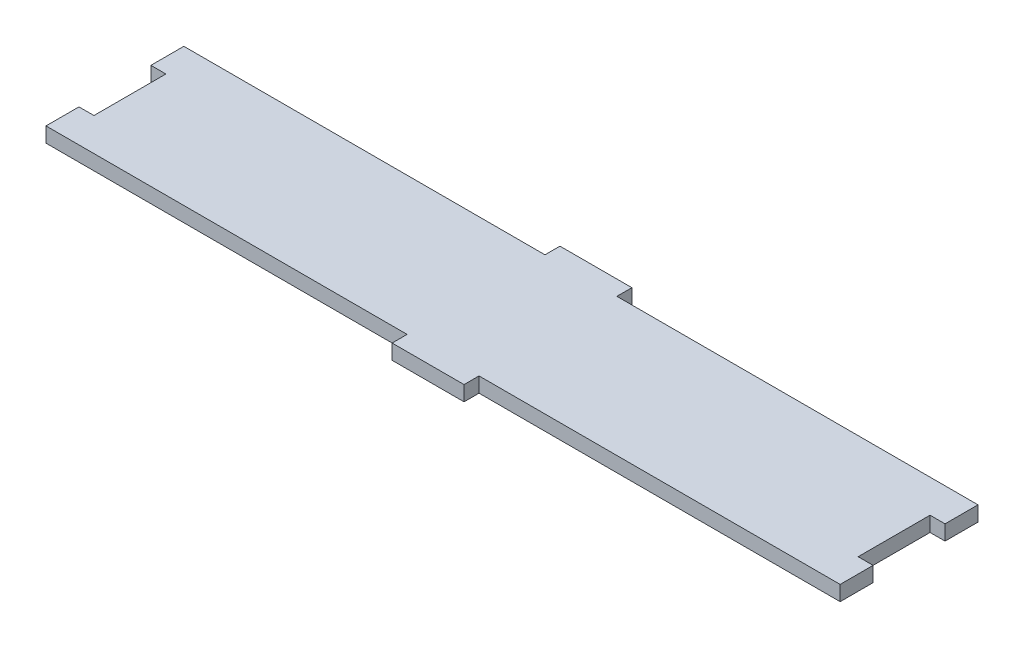
ISO-10303-21;
HEADER;
FILE_DESCRIPTION(('STEP AP214'),'2;1');
FILE_NAME('part.step','',(''),(''),'','','');
FILE_SCHEMA(('AUTOMOTIVE_DESIGN { 1 0 10303 214 1 1 1 1 }'));
ENDSEC;
DATA;
#1=APPLICATION_CONTEXT('core data for automotive mechanical design processes');
#2=APPLICATION_PROTOCOL_DEFINITION('international standard','automotive_design',2000,#1);
#3=PRODUCT_CONTEXT('',#1,'mechanical');
#4=PRODUCT('Part','Part','',(#3));
#5=PRODUCT_RELATED_PRODUCT_CATEGORY('part','',(#4));
#6=PRODUCT_DEFINITION_FORMATION('','',#4);
#7=PRODUCT_DEFINITION_CONTEXT('part definition',#1,'design');
#8=PRODUCT_DEFINITION('design','',#6,#7);
#9=PRODUCT_DEFINITION_SHAPE('','',#8);
#10=(LENGTH_UNIT() NAMED_UNIT(*) SI_UNIT(.MILLI.,.METRE.));
#11=(NAMED_UNIT(*) PLANE_ANGLE_UNIT() SI_UNIT($,.RADIAN.));
#12=(NAMED_UNIT(*) SI_UNIT($,.STERADIAN.) SOLID_ANGLE_UNIT());
#13=UNCERTAINTY_MEASURE_WITH_UNIT(LENGTH_MEASURE(1.E-05),#10,'distance_accuracy_value','');
#14=(GEOMETRIC_REPRESENTATION_CONTEXT(3) GLOBAL_UNCERTAINTY_ASSIGNED_CONTEXT((#13)) GLOBAL_UNIT_ASSIGNED_CONTEXT((#10,
#11,#12)) REPRESENTATION_CONTEXT('',''));
#15=CARTESIAN_POINT('',(0.,0.,0.));
#16=DIRECTION('',(0.,0.,1.));
#17=DIRECTION('',(1.,0.,0.));
#18=AXIS2_PLACEMENT_3D('',#15,#16,#17);
#19=CARTESIAN_POINT('',(-336.55,6.35,0.));
#20=DIRECTION('',(1.,0.,0.));
#21=DIRECTION('',(0.,0.,-1.));
#22=AXIS2_PLACEMENT_3D('',#19,#20,#21);
#23=PLANE('',#22);
#24=DIRECTION('',(0.,0.,1.));
#25=VECTOR('',#24,1.);
#26=CARTESIAN_POINT('',(-336.55,0.,0.));
#27=LINE('',#26,#25);
#28=CARTESIAN_POINT('',(-336.55,0.,0.));
#29=VERTEX_POINT('',#28);
#30=CARTESIAN_POINT('',(-336.55,0.,13.97));
#31=VERTEX_POINT('',#30);
#32=EDGE_CURVE('E206',#29,#31,#27,.T.);
#33=ORIENTED_EDGE('',*,*,#32,.T.);
#34=DIRECTION('',(0.,1.,0.));
#35=VECTOR('',#34,1.);
#36=CARTESIAN_POINT('',(-336.55,0.,13.97));
#37=LINE('',#36,#35);
#38=CARTESIAN_POINT('',(-336.55,6.35,13.97));
#39=VERTEX_POINT('',#38);
#40=EDGE_CURVE('E276',#31,#39,#37,.T.);
#41=ORIENTED_EDGE('',*,*,#40,.T.);
#42=DIRECTION('',(0.,0.,1.));
#43=VECTOR('',#42,1.);
#44=CARTESIAN_POINT('',(-336.55,6.35,0.));
#45=LINE('',#44,#43);
#46=CARTESIAN_POINT('',(-336.55,6.35,0.));
#47=VERTEX_POINT('',#46);
#48=EDGE_CURVE('E260',#47,#39,#45,.T.);
#49=ORIENTED_EDGE('',*,*,#48,.F.);
#50=DIRECTION('',(0.,-1.,0.));
#51=VECTOR('',#50,1.);
#52=CARTESIAN_POINT('',(-336.55,6.35,0.));
#53=LINE('',#52,#51);
#54=EDGE_CURVE('E49',#47,#29,#53,.T.);
#55=ORIENTED_EDGE('',*,*,#54,.T.);
#56=EDGE_LOOP('',(#33,#41,#49,#55));
#57=FACE_BOUND('',#56,.T.);
#58=ADVANCED_FACE('F39',(#57),#23,.F.);
#59=CARTESIAN_POINT('',(0.,6.35,0.));
#60=DIRECTION('',(1.,0.,0.));
#61=DIRECTION('',(0.,0.,-1.));
#62=AXIS2_PLACEMENT_3D('',#59,#60,#61);
#63=PLANE('',#62);
#64=DIRECTION('',(0.,1.,0.));
#65=VECTOR('',#64,1.);
#66=CARTESIAN_POINT('',(0.,0.,44.45));
#67=LINE('',#66,#65);
#68=CARTESIAN_POINT('',(0.,0.,44.45));
#69=VERTEX_POINT('',#68);
#70=CARTESIAN_POINT('',(0.,6.35,44.45));
#71=VERTEX_POINT('',#70);
#72=EDGE_CURVE('E425',#69,#71,#67,.T.);
#73=ORIENTED_EDGE('',*,*,#72,.T.);
#74=DIRECTION('',(0.,0.,1.));
#75=VECTOR('',#74,1.);
#76=CARTESIAN_POINT('',(0.,6.35,0.));
#77=LINE('',#76,#75);
#78=CARTESIAN_POINT('',(0.,6.35,58.42));
#79=VERTEX_POINT('',#78);
#80=EDGE_CURVE('E448',#71,#79,#77,.T.);
#81=ORIENTED_EDGE('',*,*,#80,.T.);
#82=DIRECTION('',(0.,-1.,0.));
#83=VECTOR('',#82,1.);
#84=CARTESIAN_POINT('',(0.,6.35,58.42));
#85=LINE('',#84,#83);
#86=CARTESIAN_POINT('',(0.,0.,58.42));
#87=VERTEX_POINT('',#86);
#88=EDGE_CURVE('E237',#79,#87,#85,.T.);
#89=ORIENTED_EDGE('',*,*,#88,.T.);
#90=DIRECTION('',(0.,0.,1.));
#91=VECTOR('',#90,1.);
#92=CARTESIAN_POINT('',(0.,0.,0.));
#93=LINE('',#92,#91);
#94=EDGE_CURVE('E286',#69,#87,#93,.T.);
#95=ORIENTED_EDGE('',*,*,#94,.F.);
#96=EDGE_LOOP('',(#73,#81,#89,#95));
#97=FACE_BOUND('',#96,.T.);
#98=ADVANCED_FACE('F347',(#97),#63,.T.);
#99=CARTESIAN_POINT('',(-183.515,6.35,0.));
#100=DIRECTION('',(-1.,0.,0.));
#101=DIRECTION('',(0.,0.,1.));
#102=AXIS2_PLACEMENT_3D('',#99,#100,#101);
#103=PLANE('',#102);
#104=DIRECTION('',(0.,0.,-1.));
#105=VECTOR('',#104,1.);
#106=CARTESIAN_POINT('',(-183.515,0.,0.));
#107=LINE('',#106,#105);
#108=CARTESIAN_POINT('',(-183.515,0.,0.));
#109=VERTEX_POINT('',#108);
#110=CARTESIAN_POINT('',(-183.515,0.,-6.34999999999999));
#111=VERTEX_POINT('',#110);
#112=EDGE_CURVE('E271',#109,#111,#107,.T.);
#113=ORIENTED_EDGE('',*,*,#112,.F.);
#114=DIRECTION('',(0.,-1.,0.));
#115=VECTOR('',#114,1.);
#116=CARTESIAN_POINT('',(-183.515,6.35,0.));
#117=LINE('',#116,#115);
#118=CARTESIAN_POINT('',(-183.515,6.35,0.));
#119=VERTEX_POINT('',#118);
#120=EDGE_CURVE('E11',#119,#109,#117,.T.);
#121=ORIENTED_EDGE('',*,*,#120,.F.);
#122=DIRECTION('',(0.,0.,-1.));
#123=VECTOR('',#122,1.);
#124=CARTESIAN_POINT('',(-183.515,6.35,0.));
#125=LINE('',#124,#123);
#126=CARTESIAN_POINT('',(-183.515,6.35,-6.34999999999999));
#127=VERTEX_POINT('',#126);
#128=EDGE_CURVE('E217',#119,#127,#125,.T.);
#129=ORIENTED_EDGE('',*,*,#128,.T.);
#130=DIRECTION('',(0.,-1.,0.));
#131=VECTOR('',#130,1.);
#132=CARTESIAN_POINT('',(-183.515,6.35,-6.34999999999999));
#133=LINE('',#132,#131);
#134=EDGE_CURVE('E43',#127,#111,#133,.T.);
#135=ORIENTED_EDGE('',*,*,#134,.T.);
#136=EDGE_LOOP('',(#113,#121,#129,#135));
#137=FACE_BOUND('',#136,.T.);
#138=ADVANCED_FACE('F41',(#137),#103,.T.);
#139=CARTESIAN_POINT('',(-183.515,6.35,0.));
#140=DIRECTION('',(0.,0.,1.));
#141=DIRECTION('',(1.,0.,0.));
#142=AXIS2_PLACEMENT_3D('',#139,#140,#141);
#143=PLANE('',#142);
#144=DIRECTION('',(-1.,0.,0.));
#145=VECTOR('',#144,1.);
#146=CARTESIAN_POINT('',(-183.515,0.,0.));
#147=LINE('',#146,#145);
#148=EDGE_CURVE('E211',#109,#29,#147,.T.);
#149=ORIENTED_EDGE('',*,*,#148,.T.);
#150=ORIENTED_EDGE('',*,*,#54,.F.);
#151=DIRECTION('',(-1.,0.,0.));
#152=VECTOR('',#151,1.);
#153=CARTESIAN_POINT('',(-183.515,6.35,0.));
#154=LINE('',#153,#152);
#155=EDGE_CURVE('E255',#119,#47,#154,.T.);
#156=ORIENTED_EDGE('',*,*,#155,.F.);
#157=ORIENTED_EDGE('',*,*,#120,.T.);
#158=EDGE_LOOP('',(#149,#150,#156,#157));
#159=FACE_BOUND('',#158,.T.);
#160=ADVANCED_FACE('F344',(#159),#143,.F.);
#161=CARTESIAN_POINT('',(-336.55,6.35,44.45));
#162=VERTEX_POINT('',#161);
#163=CARTESIAN_POINT('',(-336.55,6.35,58.42));
#164=VERTEX_POINT('',#163);
#165=EDGE_CURVE('E195',#162,#164,#45,.T.);
#166=ORIENTED_EDGE('',*,*,#165,.F.);
#167=DIRECTION('',(0.,1.,0.));
#168=VECTOR('',#167,1.);
#169=CARTESIAN_POINT('',(-336.55,0.,44.45));
#170=LINE('',#169,#168);
#171=CARTESIAN_POINT('',(-336.55,0.,44.45));
#172=VERTEX_POINT('',#171);
#173=EDGE_CURVE('E181',#172,#162,#170,.T.);
#174=ORIENTED_EDGE('',*,*,#173,.F.);
#175=CARTESIAN_POINT('',(-336.55,0.,58.42));
#176=VERTEX_POINT('',#175);
#177=EDGE_CURVE('E193',#172,#176,#27,.T.);
#178=ORIENTED_EDGE('',*,*,#177,.T.);
#179=DIRECTION('',(0.,-1.,0.));
#180=VECTOR('',#179,1.);
#181=CARTESIAN_POINT('',(-336.55,6.35,58.42));
#182=LINE('',#181,#180);
#183=EDGE_CURVE('E222',#164,#176,#182,.T.);
#184=ORIENTED_EDGE('',*,*,#183,.F.);
#185=EDGE_LOOP('',(#166,#174,#178,#184));
#186=FACE_BOUND('',#185,.T.);
#187=ADVANCED_FACE('F191',(#186),#23,.F.);
#188=CARTESIAN_POINT('',(-183.515,6.35,58.42));
#189=DIRECTION('',(0.,0.,1.));
#190=DIRECTION('',(1.,0.,0.));
#191=AXIS2_PLACEMENT_3D('',#188,#189,#190);
#192=PLANE('',#191);
#193=DIRECTION('',(-1.,0.,0.));
#194=VECTOR('',#193,1.);
#195=CARTESIAN_POINT('',(-183.515,0.,58.42));
#196=LINE('',#195,#194);
#197=CARTESIAN_POINT('',(-183.515,0.,58.42));
#198=VERTEX_POINT('',#197);
#199=EDGE_CURVE('E204',#198,#176,#196,.T.);
#200=ORIENTED_EDGE('',*,*,#199,.F.);
#201=DIRECTION('',(0.,-1.,0.));
#202=VECTOR('',#201,1.);
#203=CARTESIAN_POINT('',(-183.515,6.35,58.42));
#204=LINE('',#203,#202);
#205=CARTESIAN_POINT('',(-183.515,6.35,58.42));
#206=VERTEX_POINT('',#205);
#207=EDGE_CURVE('E225',#206,#198,#204,.T.);
#208=ORIENTED_EDGE('',*,*,#207,.F.);
#209=DIRECTION('',(-1.,0.,0.));
#210=VECTOR('',#209,1.);
#211=CARTESIAN_POINT('',(-183.515,6.35,58.42));
#212=LINE('',#211,#210);
#213=EDGE_CURVE('E323',#206,#164,#212,.T.);
#214=ORIENTED_EDGE('',*,*,#213,.T.);
#215=ORIENTED_EDGE('',*,*,#183,.T.);
#216=EDGE_LOOP('',(#200,#208,#214,#215));
#217=FACE_BOUND('',#216,.T.);
#218=ADVANCED_FACE('F336',(#217),#192,.T.);
#219=CARTESIAN_POINT('',(-183.515,6.35,58.42));
#220=DIRECTION('',(1.,0.,0.));
#221=DIRECTION('',(0.,0.,-1.));
#222=AXIS2_PLACEMENT_3D('',#219,#220,#221);
#223=PLANE('',#222);
#224=DIRECTION('',(0.,0.,1.));
#225=VECTOR('',#224,1.);
#226=CARTESIAN_POINT('',(-183.515,0.,58.42));
#227=LINE('',#226,#225);
#228=CARTESIAN_POINT('',(-183.515,0.,64.77));
#229=VERTEX_POINT('',#228);
#230=EDGE_CURVE('E212',#198,#229,#227,.T.);
#231=ORIENTED_EDGE('',*,*,#230,.T.);
#232=DIRECTION('',(0.,-1.,0.));
#233=VECTOR('',#232,1.);
#234=CARTESIAN_POINT('',(-183.515,6.35,64.77));
#235=LINE('',#234,#233);
#236=CARTESIAN_POINT('',(-183.515,6.35,64.77));
#237=VERTEX_POINT('',#236);
#238=EDGE_CURVE('E228',#237,#229,#235,.T.);
#239=ORIENTED_EDGE('',*,*,#238,.F.);
#240=DIRECTION('',(0.,0.,1.));
#241=VECTOR('',#240,1.);
#242=CARTESIAN_POINT('',(-183.515,6.35,58.42));
#243=LINE('',#242,#241);
#244=EDGE_CURVE('E318',#206,#237,#243,.T.);
#245=ORIENTED_EDGE('',*,*,#244,.F.);
#246=ORIENTED_EDGE('',*,*,#207,.T.);
#247=EDGE_LOOP('',(#231,#239,#245,#246));
#248=FACE_BOUND('',#247,.T.);
#249=ADVANCED_FACE('F306',(#248),#223,.F.);
#250=CARTESIAN_POINT('',(-153.035,6.35,64.77));
#251=DIRECTION('',(0.,0.,1.));
#252=DIRECTION('',(1.,0.,0.));
#253=AXIS2_PLACEMENT_3D('',#250,#251,#252);
#254=PLANE('',#253);
#255=DIRECTION('',(-1.,0.,0.));
#256=VECTOR('',#255,1.);
#257=CARTESIAN_POINT('',(-153.035,0.,64.77));
#258=LINE('',#257,#256);
#259=CARTESIAN_POINT('',(-153.035,0.,64.77));
#260=VERTEX_POINT('',#259);
#261=EDGE_CURVE('E299',#260,#229,#258,.T.);
#262=ORIENTED_EDGE('',*,*,#261,.F.);
#263=DIRECTION('',(0.,-1.,0.));
#264=VECTOR('',#263,1.);
#265=CARTESIAN_POINT('',(-153.035,6.35,64.77));
#266=LINE('',#265,#264);
#267=CARTESIAN_POINT('',(-153.035,6.35,64.77));
#268=VERTEX_POINT('',#267);
#269=EDGE_CURVE('E231',#268,#260,#266,.T.);
#270=ORIENTED_EDGE('',*,*,#269,.F.);
#271=DIRECTION('',(-1.,0.,0.));
#272=VECTOR('',#271,1.);
#273=CARTESIAN_POINT('',(-153.035,6.35,64.77));
#274=LINE('',#273,#272);
#275=EDGE_CURVE('E314',#268,#237,#274,.T.);
#276=ORIENTED_EDGE('',*,*,#275,.T.);
#277=ORIENTED_EDGE('',*,*,#238,.T.);
#278=EDGE_LOOP('',(#262,#270,#276,#277));
#279=FACE_BOUND('',#278,.T.);
#280=ADVANCED_FACE('F312',(#279),#254,.T.);
#281=CARTESIAN_POINT('',(-153.035,6.35,58.42));
#282=DIRECTION('',(1.,0.,0.));
#283=DIRECTION('',(0.,0.,-1.));
#284=AXIS2_PLACEMENT_3D('',#281,#282,#283);
#285=PLANE('',#284);
#286=DIRECTION('',(0.,0.,1.));
#287=VECTOR('',#286,1.);
#288=CARTESIAN_POINT('',(-153.035,0.,58.42));
#289=LINE('',#288,#287);
#290=CARTESIAN_POINT('',(-153.035,0.,58.42));
#291=VERTEX_POINT('',#290);
#292=EDGE_CURVE('E295',#291,#260,#289,.T.);
#293=ORIENTED_EDGE('',*,*,#292,.F.);
#294=DIRECTION('',(0.,-1.,0.));
#295=VECTOR('',#294,1.);
#296=CARTESIAN_POINT('',(-153.035,6.35,58.42));
#297=LINE('',#296,#295);
#298=CARTESIAN_POINT('',(-153.035,6.35,58.42));
#299=VERTEX_POINT('',#298);
#300=EDGE_CURVE('E234',#299,#291,#297,.T.);
#301=ORIENTED_EDGE('',*,*,#300,.F.);
#302=DIRECTION('',(0.,0.,1.));
#303=VECTOR('',#302,1.);
#304=CARTESIAN_POINT('',(-153.035,6.35,58.42));
#305=LINE('',#304,#303);
#306=EDGE_CURVE('E319',#299,#268,#305,.T.);
#307=ORIENTED_EDGE('',*,*,#306,.T.);
#308=ORIENTED_EDGE('',*,*,#269,.T.);
#309=EDGE_LOOP('',(#293,#301,#307,#308));
#310=FACE_BOUND('',#309,.T.);
#311=ADVANCED_FACE('F462',(#310),#285,.T.);
#312=CARTESIAN_POINT('',(0.,6.35,58.42));
#313=DIRECTION('',(0.,0.,1.));
#314=DIRECTION('',(1.,0.,0.));
#315=AXIS2_PLACEMENT_3D('',#312,#313,#314);
#316=PLANE('',#315);
#317=DIRECTION('',(-1.,0.,0.));
#318=VECTOR('',#317,1.);
#319=CARTESIAN_POINT('',(0.,0.,58.42));
#320=LINE('',#319,#318);
#321=EDGE_CURVE('E291',#87,#291,#320,.T.);
#322=ORIENTED_EDGE('',*,*,#321,.F.);
#323=ORIENTED_EDGE('',*,*,#88,.F.);
#324=DIRECTION('',(-1.,0.,0.));
#325=VECTOR('',#324,1.);
#326=CARTESIAN_POINT('',(0.,6.35,58.42));
#327=LINE('',#326,#325);
#328=EDGE_CURVE('E325',#79,#299,#327,.T.);
#329=ORIENTED_EDGE('',*,*,#328,.T.);
#330=ORIENTED_EDGE('',*,*,#300,.T.);
#331=EDGE_LOOP('',(#322,#323,#329,#330));
#332=FACE_BOUND('',#331,.T.);
#333=ADVANCED_FACE('F458',(#332),#316,.T.);
#334=DIRECTION('',(0.,1.,0.));
#335=VECTOR('',#334,1.);
#336=CARTESIAN_POINT('',(0.,0.,13.97));
#337=LINE('',#336,#335);
#338=CARTESIAN_POINT('',(0.,0.,13.97));
#339=VERTEX_POINT('',#338);
#340=CARTESIAN_POINT('',(0.,6.35,13.97));
#341=VERTEX_POINT('',#340);
#342=EDGE_CURVE('E414',#339,#341,#337,.T.);
#343=ORIENTED_EDGE('',*,*,#342,.F.);
#344=CARTESIAN_POINT('',(0.,0.,0.));
#345=VERTEX_POINT('',#344);
#346=EDGE_CURVE('E287',#345,#339,#93,.T.);
#347=ORIENTED_EDGE('',*,*,#346,.F.);
#348=DIRECTION('',(0.,-1.,0.));
#349=VECTOR('',#348,1.);
#350=CARTESIAN_POINT('',(0.,6.35,0.));
#351=LINE('',#350,#349);
#352=CARTESIAN_POINT('',(0.,6.35,0.));
#353=VERTEX_POINT('',#352);
#354=EDGE_CURVE('E241',#353,#345,#351,.T.);
#355=ORIENTED_EDGE('',*,*,#354,.F.);
#356=EDGE_CURVE('E449',#353,#341,#77,.T.);
#357=ORIENTED_EDGE('',*,*,#356,.T.);
#358=EDGE_LOOP('',(#343,#347,#355,#357));
#359=FACE_BOUND('',#358,.T.);
#360=ADVANCED_FACE('F354',(#359),#63,.T.);
#361=CARTESIAN_POINT('',(0.,6.35,0.));
#362=DIRECTION('',(0.,0.,1.));
#363=DIRECTION('',(1.,0.,0.));
#364=AXIS2_PLACEMENT_3D('',#361,#362,#363);
#365=PLANE('',#364);
#366=DIRECTION('',(-1.,0.,0.));
#367=VECTOR('',#366,1.);
#368=CARTESIAN_POINT('',(0.,0.,0.));
#369=LINE('',#368,#367);
#370=CARTESIAN_POINT('',(-153.035,0.,0.));
#371=VERTEX_POINT('',#370);
#372=EDGE_CURVE('E283',#345,#371,#369,.T.);
#373=ORIENTED_EDGE('',*,*,#372,.T.);
#374=DIRECTION('',(0.,-1.,0.));
#375=VECTOR('',#374,1.);
#376=CARTESIAN_POINT('',(-153.035,6.35,0.));
#377=LINE('',#376,#375);
#378=CARTESIAN_POINT('',(-153.035,6.35,0.));
#379=VERTEX_POINT('',#378);
#380=EDGE_CURVE('E244',#379,#371,#377,.T.);
#381=ORIENTED_EDGE('',*,*,#380,.F.);
#382=DIRECTION('',(-1.,0.,0.));
#383=VECTOR('',#382,1.);
#384=CARTESIAN_POINT('',(0.,6.35,0.));
#385=LINE('',#384,#383);
#386=EDGE_CURVE('E445',#353,#379,#385,.T.);
#387=ORIENTED_EDGE('',*,*,#386,.F.);
#388=ORIENTED_EDGE('',*,*,#354,.T.);
#389=EDGE_LOOP('',(#373,#381,#387,#388));
#390=FACE_BOUND('',#389,.T.);
#391=ADVANCED_FACE('F477',(#390),#365,.F.);
#392=CARTESIAN_POINT('',(-153.035,6.35,0.));
#393=DIRECTION('',(-1.,0.,0.));
#394=DIRECTION('',(0.,0.,1.));
#395=AXIS2_PLACEMENT_3D('',#392,#393,#394);
#396=PLANE('',#395);
#397=DIRECTION('',(0.,0.,-1.));
#398=VECTOR('',#397,1.);
#399=CARTESIAN_POINT('',(-153.035,0.,0.));
#400=LINE('',#399,#398);
#401=CARTESIAN_POINT('',(-153.035,0.,-6.34999999999999));
#402=VERTEX_POINT('',#401);
#403=EDGE_CURVE('E280',#371,#402,#400,.T.);
#404=ORIENTED_EDGE('',*,*,#403,.T.);
#405=DIRECTION('',(0.,-1.,0.));
#406=VECTOR('',#405,1.);
#407=CARTESIAN_POINT('',(-153.035,6.35,-6.34999999999999));
#408=LINE('',#407,#406);
#409=CARTESIAN_POINT('',(-153.035,6.35,-6.34999999999999));
#410=VERTEX_POINT('',#409);
#411=EDGE_CURVE('E247',#410,#402,#408,.T.);
#412=ORIENTED_EDGE('',*,*,#411,.F.);
#413=DIRECTION('',(0.,0.,-1.));
#414=VECTOR('',#413,1.);
#415=CARTESIAN_POINT('',(-153.035,6.35,0.));
#416=LINE('',#415,#414);
#417=EDGE_CURVE('E442',#379,#410,#416,.T.);
#418=ORIENTED_EDGE('',*,*,#417,.F.);
#419=ORIENTED_EDGE('',*,*,#380,.T.);
#420=EDGE_LOOP('',(#404,#412,#418,#419));
#421=FACE_BOUND('',#420,.T.);
#422=ADVANCED_FACE('F481',(#421),#396,.F.);
#423=CARTESIAN_POINT('',(-183.515,6.35,-6.34999999999999));
#424=DIRECTION('',(0.,0.,-1.));
#425=DIRECTION('',(-1.,0.,0.));
#426=AXIS2_PLACEMENT_3D('',#423,#424,#425);
#427=PLANE('',#426);
#428=DIRECTION('',(1.,0.,0.));
#429=VECTOR('',#428,1.);
#430=CARTESIAN_POINT('',(-183.515,0.,-6.34999999999999));
#431=LINE('',#430,#429);
#432=EDGE_CURVE('E275',#111,#402,#431,.T.);
#433=ORIENTED_EDGE('',*,*,#432,.F.);
#434=ORIENTED_EDGE('',*,*,#134,.F.);
#435=DIRECTION('',(1.,0.,0.));
#436=VECTOR('',#435,1.);
#437=CARTESIAN_POINT('',(-183.515,6.35,-6.34999999999999));
#438=LINE('',#437,#436);
#439=EDGE_CURVE('E439',#127,#410,#438,.T.);
#440=ORIENTED_EDGE('',*,*,#439,.T.);
#441=ORIENTED_EDGE('',*,*,#411,.T.);
#442=EDGE_LOOP('',(#433,#434,#440,#441));
#443=FACE_BOUND('',#442,.T.);
#444=ADVANCED_FACE('F364',(#443),#427,.T.);
#445=CARTESIAN_POINT('',(0.,6.35,0.));
#446=DIRECTION('',(0.,-1.,0.));
#447=DIRECTION('',(0.,0.,-1.));
#448=AXIS2_PLACEMENT_3D('',#445,#446,#447);
#449=PLANE('',#448);
#450=ORIENTED_EDGE('',*,*,#48,.T.);
#451=DIRECTION('',(-1.,0.,0.));
#452=VECTOR('',#451,1.);
#453=CARTESIAN_POINT('',(-336.55,6.35,13.97));
#454=LINE('',#453,#452);
#455=CARTESIAN_POINT('',(-330.2,6.35,13.97));
#456=VERTEX_POINT('',#455);
#457=EDGE_CURVE('E187',#456,#39,#454,.T.);
#458=ORIENTED_EDGE('',*,*,#457,.F.);
#459=DIRECTION('',(0.,0.,-1.));
#460=VECTOR('',#459,1.);
#461=CARTESIAN_POINT('',(-330.2,6.35,13.97));
#462=LINE('',#461,#460);
#463=CARTESIAN_POINT('',(-330.2,6.35,44.45));
#464=VERTEX_POINT('',#463);
#465=EDGE_CURVE('E391',#464,#456,#462,.T.);
#466=ORIENTED_EDGE('',*,*,#465,.F.);
#467=DIRECTION('',(1.,0.,0.));
#468=VECTOR('',#467,1.);
#469=CARTESIAN_POINT('',(-336.55,6.35,44.45));
#470=LINE('',#469,#468);
#471=EDGE_CURVE('E335',#162,#464,#470,.T.);
#472=ORIENTED_EDGE('',*,*,#471,.F.);
#473=ORIENTED_EDGE('',*,*,#165,.T.);
#474=ORIENTED_EDGE('',*,*,#213,.F.);
#475=ORIENTED_EDGE('',*,*,#244,.T.);
#476=ORIENTED_EDGE('',*,*,#275,.F.);
#477=ORIENTED_EDGE('',*,*,#306,.F.);
#478=ORIENTED_EDGE('',*,*,#328,.F.);
#479=ORIENTED_EDGE('',*,*,#80,.F.);
#480=DIRECTION('',(1.,0.,0.));
#481=VECTOR('',#480,1.);
#482=CARTESIAN_POINT('',(0.,6.35,44.45));
#483=LINE('',#482,#481);
#484=CARTESIAN_POINT('',(-6.34999999999999,6.35,44.45));
#485=VERTEX_POINT('',#484);
#486=EDGE_CURVE('E407',#485,#71,#483,.T.);
#487=ORIENTED_EDGE('',*,*,#486,.F.);
#488=DIRECTION('',(0.,0.,1.));
#489=VECTOR('',#488,1.);
#490=CARTESIAN_POINT('',(-6.35,6.35,13.97));
#491=LINE('',#490,#489);
#492=CARTESIAN_POINT('',(-6.35,6.35,13.97));
#493=VERTEX_POINT('',#492);
#494=EDGE_CURVE('E419',#493,#485,#491,.T.);
#495=ORIENTED_EDGE('',*,*,#494,.F.);
#496=DIRECTION('',(-1.,0.,0.));
#497=VECTOR('',#496,1.);
#498=CARTESIAN_POINT('',(0.,6.35,13.97));
#499=LINE('',#498,#497);
#500=EDGE_CURVE('E415',#341,#493,#499,.T.);
#501=ORIENTED_EDGE('',*,*,#500,.F.);
#502=ORIENTED_EDGE('',*,*,#356,.F.);
#503=ORIENTED_EDGE('',*,*,#386,.T.);
#504=ORIENTED_EDGE('',*,*,#417,.T.);
#505=ORIENTED_EDGE('',*,*,#439,.F.);
#506=ORIENTED_EDGE('',*,*,#128,.F.);
#507=ORIENTED_EDGE('',*,*,#155,.T.);
#508=EDGE_LOOP('',(#450,#458,#466,#472,#473,#474,#475,#476,#477,#478,#479,#487,#495,#501,#502,
#503,#504,#505,#506,#507));
#509=FACE_BOUND('',#508,.T.);
#510=ADVANCED_FACE('F333',(#509),#449,.F.);
#511=CARTESIAN_POINT('',(0.,0.,0.));
#512=DIRECTION('',(0.,-1.,0.));
#513=DIRECTION('',(0.,0.,-1.));
#514=AXIS2_PLACEMENT_3D('',#511,#512,#513);
#515=PLANE('',#514);
#516=DIRECTION('',(-1.,0.,0.));
#517=VECTOR('',#516,1.);
#518=CARTESIAN_POINT('',(-336.55,0.,13.97));
#519=LINE('',#518,#517);
#520=CARTESIAN_POINT('',(-330.2,0.,13.97));
#521=VERTEX_POINT('',#520);
#522=EDGE_CURVE('E197',#521,#31,#519,.T.);
#523=ORIENTED_EDGE('',*,*,#522,.T.);
#524=ORIENTED_EDGE('',*,*,#32,.F.);
#525=ORIENTED_EDGE('',*,*,#148,.F.);
#526=ORIENTED_EDGE('',*,*,#112,.T.);
#527=ORIENTED_EDGE('',*,*,#432,.T.);
#528=ORIENTED_EDGE('',*,*,#403,.F.);
#529=ORIENTED_EDGE('',*,*,#372,.F.);
#530=ORIENTED_EDGE('',*,*,#346,.T.);
#531=DIRECTION('',(-1.,0.,0.));
#532=VECTOR('',#531,1.);
#533=CARTESIAN_POINT('',(0.,0.,13.97));
#534=LINE('',#533,#532);
#535=CARTESIAN_POINT('',(-6.35,0.,13.97));
#536=VERTEX_POINT('',#535);
#537=EDGE_CURVE('E403',#339,#536,#534,.T.);
#538=ORIENTED_EDGE('',*,*,#537,.T.);
#539=DIRECTION('',(0.,0.,1.));
#540=VECTOR('',#539,1.);
#541=CARTESIAN_POINT('',(-6.35,0.,13.97));
#542=LINE('',#541,#540);
#543=CARTESIAN_POINT('',(-6.34999999999999,0.,44.45));
#544=VERTEX_POINT('',#543);
#545=EDGE_CURVE('E65',#536,#544,#542,.T.);
#546=ORIENTED_EDGE('',*,*,#545,.T.);
#547=DIRECTION('',(1.,0.,0.));
#548=VECTOR('',#547,1.);
#549=CARTESIAN_POINT('',(0.,0.,44.45));
#550=LINE('',#549,#548);
#551=EDGE_CURVE('E410',#544,#69,#550,.T.);
#552=ORIENTED_EDGE('',*,*,#551,.T.);
#553=ORIENTED_EDGE('',*,*,#94,.T.);
#554=ORIENTED_EDGE('',*,*,#321,.T.);
#555=ORIENTED_EDGE('',*,*,#292,.T.);
#556=ORIENTED_EDGE('',*,*,#261,.T.);
#557=ORIENTED_EDGE('',*,*,#230,.F.);
#558=ORIENTED_EDGE('',*,*,#199,.T.);
#559=ORIENTED_EDGE('',*,*,#177,.F.);
#560=DIRECTION('',(1.,0.,0.));
#561=VECTOR('',#560,1.);
#562=CARTESIAN_POINT('',(-336.55,0.,44.45));
#563=LINE('',#562,#561);
#564=CARTESIAN_POINT('',(-330.2,0.,44.45));
#565=VERTEX_POINT('',#564);
#566=EDGE_CURVE('E177',#172,#565,#563,.T.);
#567=ORIENTED_EDGE('',*,*,#566,.T.);
#568=DIRECTION('',(0.,0.,-1.));
#569=VECTOR('',#568,1.);
#570=CARTESIAN_POINT('',(-330.2,0.,13.97));
#571=LINE('',#570,#569);
#572=EDGE_CURVE('E57',#565,#521,#571,.T.);
#573=ORIENTED_EDGE('',*,*,#572,.T.);
#574=EDGE_LOOP('',(#523,#524,#525,#526,#527,#528,#529,#530,#538,#546,#552,#553,#554,#555,#556,
#557,#558,#559,#567,#573));
#575=FACE_BOUND('',#574,.T.);
#576=ADVANCED_FACE('F201',(#575),#515,.T.);
#577=CARTESIAN_POINT('',(0.,0.,44.45));
#578=DIRECTION('',(0.,0.,1.));
#579=DIRECTION('',(1.,0.,0.));
#580=AXIS2_PLACEMENT_3D('',#577,#578,#579);
#581=PLANE('',#580);
#582=ORIENTED_EDGE('',*,*,#486,.T.);
#583=ORIENTED_EDGE('',*,*,#72,.F.);
#584=ORIENTED_EDGE('',*,*,#551,.F.);
#585=DIRECTION('',(0.,1.,0.));
#586=VECTOR('',#585,1.);
#587=CARTESIAN_POINT('',(-6.34999999999999,0.,44.45));
#588=LINE('',#587,#586);
#589=EDGE_CURVE('E429',#544,#485,#588,.T.);
#590=ORIENTED_EDGE('',*,*,#589,.T.);
#591=EDGE_LOOP('',(#582,#583,#584,#590));
#592=FACE_BOUND('',#591,.T.);
#593=ADVANCED_FACE('F361',(#592),#581,.F.);
#594=CARTESIAN_POINT('',(-6.35,0.,13.97));
#595=DIRECTION('',(-1.,0.,0.));
#596=DIRECTION('',(0.,0.,1.));
#597=AXIS2_PLACEMENT_3D('',#594,#595,#596);
#598=PLANE('',#597);
#599=ORIENTED_EDGE('',*,*,#494,.T.);
#600=ORIENTED_EDGE('',*,*,#589,.F.);
#601=ORIENTED_EDGE('',*,*,#545,.F.);
#602=DIRECTION('',(0.,1.,0.));
#603=VECTOR('',#602,1.);
#604=CARTESIAN_POINT('',(-6.35,0.,13.97));
#605=LINE('',#604,#603);
#606=EDGE_CURVE('E432',#536,#493,#605,.T.);
#607=ORIENTED_EDGE('',*,*,#606,.T.);
#608=EDGE_LOOP('',(#599,#600,#601,#607));
#609=FACE_BOUND('',#608,.T.);
#610=ADVANCED_FACE('F369',(#609),#598,.F.);
#611=CARTESIAN_POINT('',(0.,0.,13.97));
#612=DIRECTION('',(0.,0.,-1.));
#613=DIRECTION('',(-1.,0.,0.));
#614=AXIS2_PLACEMENT_3D('',#611,#612,#613);
#615=PLANE('',#614);
#616=ORIENTED_EDGE('',*,*,#500,.T.);
#617=ORIENTED_EDGE('',*,*,#606,.F.);
#618=ORIENTED_EDGE('',*,*,#537,.F.);
#619=ORIENTED_EDGE('',*,*,#342,.T.);
#620=EDGE_LOOP('',(#616,#617,#618,#619));
#621=FACE_BOUND('',#620,.T.);
#622=ADVANCED_FACE('F365',(#621),#615,.F.);
#623=CARTESIAN_POINT('',(-336.55,0.,13.97));
#624=DIRECTION('',(0.,0.,-1.));
#625=DIRECTION('',(-1.,0.,0.));
#626=AXIS2_PLACEMENT_3D('',#623,#624,#625);
#627=PLANE('',#626);
#628=ORIENTED_EDGE('',*,*,#457,.T.);
#629=ORIENTED_EDGE('',*,*,#40,.F.);
#630=ORIENTED_EDGE('',*,*,#522,.F.);
#631=DIRECTION('',(0.,1.,0.));
#632=VECTOR('',#631,1.);
#633=CARTESIAN_POINT('',(-330.2,0.,13.97));
#634=LINE('',#633,#632);
#635=EDGE_CURVE('E388',#521,#456,#634,.T.);
#636=ORIENTED_EDGE('',*,*,#635,.T.);
#637=EDGE_LOOP('',(#628,#629,#630,#636));
#638=FACE_BOUND('',#637,.T.);
#639=ADVANCED_FACE('F368',(#638),#627,.F.);
#640=CARTESIAN_POINT('',(-330.2,0.,13.97));
#641=DIRECTION('',(1.,0.,0.));
#642=DIRECTION('',(0.,0.,-1.));
#643=AXIS2_PLACEMENT_3D('',#640,#641,#642);
#644=PLANE('',#643);
#645=ORIENTED_EDGE('',*,*,#465,.T.);
#646=ORIENTED_EDGE('',*,*,#635,.F.);
#647=ORIENTED_EDGE('',*,*,#572,.F.);
#648=DIRECTION('',(0.,1.,0.));
#649=VECTOR('',#648,1.);
#650=CARTESIAN_POINT('',(-330.2,0.,44.45));
#651=LINE('',#650,#649);
#652=EDGE_CURVE('E183',#565,#464,#651,.T.);
#653=ORIENTED_EDGE('',*,*,#652,.T.);
#654=EDGE_LOOP('',(#645,#646,#647,#653));
#655=FACE_BOUND('',#654,.T.);
#656=ADVANCED_FACE('F378',(#655),#644,.F.);
#657=CARTESIAN_POINT('',(-336.55,0.,44.45));
#658=DIRECTION('',(0.,0.,1.));
#659=DIRECTION('',(1.,0.,0.));
#660=AXIS2_PLACEMENT_3D('',#657,#658,#659);
#661=PLANE('',#660);
#662=ORIENTED_EDGE('',*,*,#471,.T.);
#663=ORIENTED_EDGE('',*,*,#652,.F.);
#664=ORIENTED_EDGE('',*,*,#566,.F.);
#665=ORIENTED_EDGE('',*,*,#173,.T.);
#666=EDGE_LOOP('',(#662,#663,#664,#665));
#667=FACE_BOUND('',#666,.T.);
#668=ADVANCED_FACE('F180',(#667),#661,.F.);
#669=CLOSED_SHELL('',(#58,#98,#138,#160,#187,#218,#249,#280,#311,#333,#360,#391,#422,#444,#510,
#576,#593,#610,#622,#639,#656,#668));
#670=MANIFOLD_SOLID_BREP('B2',#669);
#671=ADVANCED_BREP_SHAPE_REPRESENTATION('',(#18,#670),#14);
#672=SHAPE_DEFINITION_REPRESENTATION(#9,#671);
ENDSEC;
END-ISO-10303-21;
